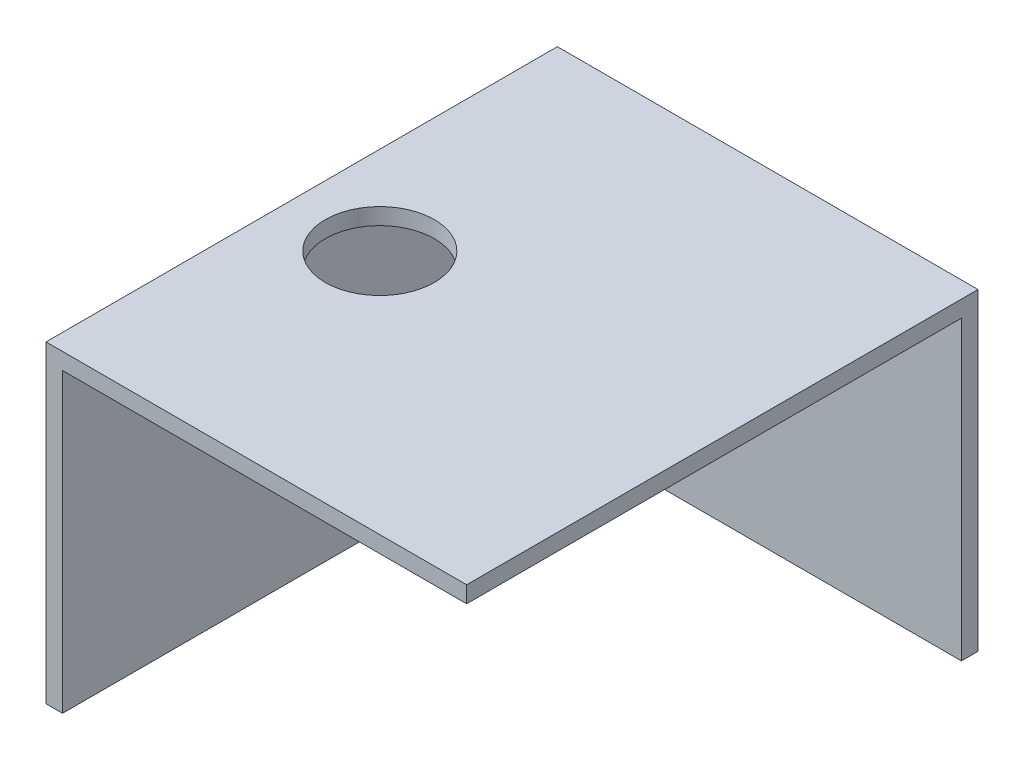
ISO-10303-21;
HEADER;
FILE_DESCRIPTION(('STEP AP214'),'2;1');
FILE_NAME('part.step','',(''),(''),'','','');
FILE_SCHEMA(('AUTOMOTIVE_DESIGN { 1 0 10303 214 1 1 1 1 }'));
ENDSEC;
DATA;
#1=APPLICATION_CONTEXT('core data for automotive mechanical design processes');
#2=APPLICATION_PROTOCOL_DEFINITION('international standard','automotive_design',2000,#1);
#3=PRODUCT_CONTEXT('',#1,'mechanical');
#4=PRODUCT('Part','Part','',(#3));
#5=PRODUCT_RELATED_PRODUCT_CATEGORY('part','',(#4));
#6=PRODUCT_DEFINITION_FORMATION('','',#4);
#7=PRODUCT_DEFINITION_CONTEXT('part definition',#1,'design');
#8=PRODUCT_DEFINITION('design','',#6,#7);
#9=PRODUCT_DEFINITION_SHAPE('','',#8);
#10=(LENGTH_UNIT() NAMED_UNIT(*) SI_UNIT(.MILLI.,.METRE.));
#11=(NAMED_UNIT(*) PLANE_ANGLE_UNIT() SI_UNIT($,.RADIAN.));
#12=(NAMED_UNIT(*) SI_UNIT($,.STERADIAN.) SOLID_ANGLE_UNIT());
#13=UNCERTAINTY_MEASURE_WITH_UNIT(LENGTH_MEASURE(1.E-05),#10,'distance_accuracy_value','');
#14=(GEOMETRIC_REPRESENTATION_CONTEXT(3) GLOBAL_UNCERTAINTY_ASSIGNED_CONTEXT((#13)) GLOBAL_UNIT_ASSIGNED_CONTEXT((#10,
#11,#12)) REPRESENTATION_CONTEXT('',''));
#15=CARTESIAN_POINT('',(0.,0.,0.));
#16=DIRECTION('',(0.,0.,1.));
#17=DIRECTION('',(1.,0.,0.));
#18=AXIS2_PLACEMENT_3D('',#15,#16,#17);
#19=CARTESIAN_POINT('',(-62.1012572167531,72.274050100301,96.8075031768886));
#20=DIRECTION('',(0.,0.,1.));
#21=DIRECTION('',(1.,0.,0.));
#22=AXIS2_PLACEMENT_3D('',#19,#20,#21);
#23=PLANE('',#22);
#24=DIRECTION('',(1.,0.,0.));
#25=VECTOR('',#24,1.);
#26=CARTESIAN_POINT('',(-62.1012572167531,74.274050100301,96.8075031768886));
#27=LINE('',#26,#25);
#28=CARTESIAN_POINT('',(-64.1012572167531,74.274050100301,96.8075031768886));
#29=VERTEX_POINT('',#28);
#30=CARTESIAN_POINT('',(-13.1012572167531,74.274050100301,96.8075031768886));
#31=VERTEX_POINT('',#30);
#32=EDGE_CURVE('E99',#29,#31,#27,.T.);
#33=ORIENTED_EDGE('',*,*,#32,.F.);
#34=DIRECTION('',(0.,-1.,0.));
#35=VECTOR('',#34,1.);
#36=CARTESIAN_POINT('',(-64.1012572167531,74.274050100301,96.8075031768886));
#37=LINE('',#36,#35);
#38=CARTESIAN_POINT('',(-64.1012572167531,36.274050100301,96.8075031768886));
#39=VERTEX_POINT('',#38);
#40=EDGE_CURVE('E102',#29,#39,#37,.T.);
#41=ORIENTED_EDGE('',*,*,#40,.T.);
#42=DIRECTION('',(1.,0.,0.));
#43=VECTOR('',#42,1.);
#44=CARTESIAN_POINT('',(-44.9045137990428,36.274050100301,96.8075031768886));
#45=LINE('',#44,#43);
#46=CARTESIAN_POINT('',(-62.1012572167531,36.274050100301,96.8075031768886));
#47=VERTEX_POINT('',#46);
#48=EDGE_CURVE('E135',#39,#47,#45,.T.);
#49=ORIENTED_EDGE('',*,*,#48,.T.);
#50=DIRECTION('',(0.,-1.,0.));
#51=VECTOR('',#50,1.);
#52=CARTESIAN_POINT('',(-62.1012572167531,74.274050100301,96.8075031768886));
#53=LINE('',#52,#51);
#54=CARTESIAN_POINT('',(-62.1012572167531,72.274050100301,96.8075031768886));
#55=VERTEX_POINT('',#54);
#56=EDGE_CURVE('E120',#55,#47,#53,.T.);
#57=ORIENTED_EDGE('',*,*,#56,.F.);
#58=DIRECTION('',(1.,0.,0.));
#59=VECTOR('',#58,1.);
#60=CARTESIAN_POINT('',(-62.1012572167531,72.274050100301,96.8075031768886));
#61=LINE('',#60,#59);
#62=CARTESIAN_POINT('',(-13.1012572167531,72.274050100301,96.8075031768886));
#63=VERTEX_POINT('',#62);
#64=EDGE_CURVE('E156',#55,#63,#61,.T.);
#65=ORIENTED_EDGE('',*,*,#64,.T.);
#66=DIRECTION('',(0.,1.,0.));
#67=VECTOR('',#66,1.);
#68=CARTESIAN_POINT('',(-13.1012572167531,72.274050100301,96.8075031768886));
#69=LINE('',#68,#67);
#70=EDGE_CURVE('E11',#63,#31,#69,.T.);
#71=ORIENTED_EDGE('',*,*,#70,.T.);
#72=EDGE_LOOP('',(#33,#41,#49,#57,#65,#71));
#73=FACE_BOUND('',#72,.T.);
#74=ADVANCED_FACE('F47',(#73),#23,.T.);
#75=CARTESIAN_POINT('',(-13.1012572167531,72.274050100301,36.8075031768886));
#76=DIRECTION('',(-1.,0.,0.));
#77=DIRECTION('',(0.,0.,1.));
#78=AXIS2_PLACEMENT_3D('',#75,#76,#77);
#79=PLANE('',#78);
#80=DIRECTION('',(0.,0.,1.));
#81=VECTOR('',#80,1.);
#82=CARTESIAN_POINT('',(-13.1012572167531,74.274050100301,36.8075031768886));
#83=LINE('',#82,#81);
#84=CARTESIAN_POINT('',(-13.1012572167533,74.274050100301,34.8075031768886));
#85=VERTEX_POINT('',#84);
#86=EDGE_CURVE('E109',#85,#31,#83,.T.);
#87=ORIENTED_EDGE('',*,*,#86,.T.);
#88=ORIENTED_EDGE('',*,*,#70,.F.);
#89=DIRECTION('',(0.,0.,1.));
#90=VECTOR('',#89,1.);
#91=CARTESIAN_POINT('',(-13.1012572167531,72.274050100301,36.8075031768886));
#92=LINE('',#91,#90);
#93=CARTESIAN_POINT('',(-13.1012572167531,72.274050100301,36.8075031768886));
#94=VERTEX_POINT('',#93);
#95=EDGE_CURVE('E158',#94,#63,#92,.T.);
#96=ORIENTED_EDGE('',*,*,#95,.F.);
#97=DIRECTION('',(0.,-1.,0.));
#98=VECTOR('',#97,1.);
#99=CARTESIAN_POINT('',(-13.1012572167533,74.274050100301,36.8075031768886));
#100=LINE('',#99,#98);
#101=CARTESIAN_POINT('',(-13.1012572167533,36.274050100301,36.8075031768886));
#102=VERTEX_POINT('',#101);
#103=EDGE_CURVE('E62',#94,#102,#100,.T.);
#104=ORIENTED_EDGE('',*,*,#103,.T.);
#105=DIRECTION('',(0.,0.,-1.));
#106=VECTOR('',#105,1.);
#107=CARTESIAN_POINT('',(-13.1012572167533,36.274050100301,76.0313836749102));
#108=LINE('',#107,#106);
#109=CARTESIAN_POINT('',(-13.1012572167533,36.274050100301,34.8075031768886));
#110=VERTEX_POINT('',#109);
#111=EDGE_CURVE('E131',#102,#110,#108,.T.);
#112=ORIENTED_EDGE('',*,*,#111,.T.);
#113=DIRECTION('',(0.,-1.,0.));
#114=VECTOR('',#113,1.);
#115=CARTESIAN_POINT('',(-13.1012572167533,74.274050100301,34.8075031768886));
#116=LINE('',#115,#114);
#117=EDGE_CURVE('E145',#85,#110,#116,.T.);
#118=ORIENTED_EDGE('',*,*,#117,.F.);
#119=EDGE_LOOP('',(#87,#88,#96,#104,#112,#118));
#120=FACE_BOUND('',#119,.T.);
#121=ADVANCED_FACE('F164',(#120),#79,.F.);
#122=CARTESIAN_POINT('',(-44.9045137990428,72.274050100301,76.0313836749102));
#123=DIRECTION('',(0.,-1.,0.));
#124=DIRECTION('',(0.,0.,-1.));
#125=AXIS2_PLACEMENT_3D('',#122,#123,#124);
#126=PLANE('',#125);
#127=CARTESIAN_POINT('',(-53.4045137990428,72.274050100301,67.0313836749103));
#128=DIRECTION('',(0.,1.,0.));
#129=DIRECTION('',(0.,0.,1.));
#130=AXIS2_PLACEMENT_3D('',#127,#128,#129);
#131=CIRCLE('',#130,6.60911000448082);
#132=CARTESIAN_POINT('',(-53.4045137990428,72.274050100301,73.6404936793911));
#133=VERTEX_POINT('',#132);
#134=EDGE_CURVE('E110',#133,#133,#131,.T.);
#135=ORIENTED_EDGE('',*,*,#134,.T.);
#136=EDGE_LOOP('',(#135));
#137=FACE_BOUND('',#136,.T.);
#138=ORIENTED_EDGE('',*,*,#64,.F.);
#139=DIRECTION('',(0.,0.,1.));
#140=VECTOR('',#139,1.);
#141=CARTESIAN_POINT('',(-62.1012572167531,72.274050100301,36.8075031768886));
#142=LINE('',#141,#140);
#143=CARTESIAN_POINT('',(-62.1012572167531,72.274050100301,36.8075031768886));
#144=VERTEX_POINT('',#143);
#145=EDGE_CURVE('E55',#144,#55,#142,.T.);
#146=ORIENTED_EDGE('',*,*,#145,.F.);
#147=DIRECTION('',(1.,0.,0.));
#148=VECTOR('',#147,1.);
#149=CARTESIAN_POINT('',(-62.1012572167531,72.274050100301,36.8075031768886));
#150=LINE('',#149,#148);
#151=EDGE_CURVE('E160',#144,#94,#150,.T.);
#152=ORIENTED_EDGE('',*,*,#151,.T.);
#153=ORIENTED_EDGE('',*,*,#95,.T.);
#154=EDGE_LOOP('',(#138,#146,#152,#153));
#155=FACE_BOUND('',#154,.T.);
#156=ADVANCED_FACE('F178',(#137,#155),#126,.T.);
#157=CARTESIAN_POINT('',(-53.4045137990428,72.274050100301,67.0313836749103));
#158=DIRECTION('',(0.,1.,0.));
#159=DIRECTION('',(0.,0.,1.));
#160=AXIS2_PLACEMENT_3D('',#157,#158,#159);
#161=CYLINDRICAL_SURFACE('',#160,6.60911000448082);
#162=ORIENTED_EDGE('',*,*,#134,.F.);
#163=EDGE_LOOP('',(#162));
#164=FACE_BOUND('',#163,.T.);
#165=CARTESIAN_POINT('',(-53.4045137990428,74.274050100301,67.0313836749103));
#166=DIRECTION('',(0.,1.,0.));
#167=DIRECTION('',(0.,0.,1.));
#168=AXIS2_PLACEMENT_3D('',#165,#166,#167);
#169=CIRCLE('',#168,6.60911000448082);
#170=CARTESIAN_POINT('',(-53.4045137990428,74.274050100301,73.6404936793911));
#171=VERTEX_POINT('',#170);
#172=EDGE_CURVE('E119',#171,#171,#169,.T.);
#173=ORIENTED_EDGE('',*,*,#172,.T.);
#174=EDGE_LOOP('',(#173));
#175=FACE_BOUND('',#174,.T.);
#176=ADVANCED_FACE('F183',(#164,#175),#161,.F.);
#177=CARTESIAN_POINT('',(-62.1012572167531,74.274050100301,76.0313836749102));
#178=DIRECTION('',(-1.,0.,0.));
#179=DIRECTION('',(0.,0.,1.));
#180=AXIS2_PLACEMENT_3D('',#177,#178,#179);
#181=PLANE('',#180);
#182=DIRECTION('',(0.,-1.,0.));
#183=VECTOR('',#182,1.);
#184=CARTESIAN_POINT('',(-62.1012572167531,74.274050100301,36.8075031768886));
#185=LINE('',#184,#183);
#186=CARTESIAN_POINT('',(-62.1012572167531,36.274050100301,36.8075031768886));
#187=VERTEX_POINT('',#186);
#188=EDGE_CURVE('E149',#144,#187,#185,.T.);
#189=ORIENTED_EDGE('',*,*,#188,.F.);
#190=ORIENTED_EDGE('',*,*,#145,.T.);
#191=ORIENTED_EDGE('',*,*,#56,.T.);
#192=DIRECTION('',(0.,0.,-1.));
#193=VECTOR('',#192,1.);
#194=CARTESIAN_POINT('',(-62.1012572167531,36.274050100301,76.0313836749102));
#195=LINE('',#194,#193);
#196=EDGE_CURVE('E137',#47,#187,#195,.T.);
#197=ORIENTED_EDGE('',*,*,#196,.T.);
#198=EDGE_LOOP('',(#189,#190,#191,#197));
#199=FACE_BOUND('',#198,.T.);
#200=ADVANCED_FACE('F181',(#199),#181,.F.);
#201=CARTESIAN_POINT('',(-44.9045137990428,74.274050100301,36.8075031768886));
#202=DIRECTION('',(0.,0.,1.));
#203=DIRECTION('',(1.,0.,0.));
#204=AXIS2_PLACEMENT_3D('',#201,#202,#203);
#205=PLANE('',#204);
#206=ORIENTED_EDGE('',*,*,#151,.F.);
#207=ORIENTED_EDGE('',*,*,#188,.T.);
#208=DIRECTION('',(-1.,0.,0.));
#209=VECTOR('',#208,1.);
#210=CARTESIAN_POINT('',(-44.9045137990428,36.274050100301,36.8075031768886));
#211=LINE('',#210,#209);
#212=EDGE_CURVE('E140',#102,#187,#211,.T.);
#213=ORIENTED_EDGE('',*,*,#212,.F.);
#214=ORIENTED_EDGE('',*,*,#103,.F.);
#215=EDGE_LOOP('',(#206,#207,#213,#214));
#216=FACE_BOUND('',#215,.T.);
#217=ADVANCED_FACE('F179',(#216),#205,.T.);
#218=CARTESIAN_POINT('',(-64.1012572167531,74.274050100301,76.0313836749102));
#219=DIRECTION('',(-1.,0.,0.));
#220=DIRECTION('',(0.,0.,1.));
#221=AXIS2_PLACEMENT_3D('',#218,#219,#220);
#222=PLANE('',#221);
#223=DIRECTION('',(0.,0.,-1.));
#224=VECTOR('',#223,1.);
#225=CARTESIAN_POINT('',(-64.1012572167531,36.274050100301,76.0313836749102));
#226=LINE('',#225,#224);
#227=CARTESIAN_POINT('',(-64.1012572167531,36.274050100301,34.8075031768886));
#228=VERTEX_POINT('',#227);
#229=EDGE_CURVE('E118',#39,#228,#226,.T.);
#230=ORIENTED_EDGE('',*,*,#229,.F.);
#231=ORIENTED_EDGE('',*,*,#40,.F.);
#232=DIRECTION('',(0.,0.,-1.));
#233=VECTOR('',#232,1.);
#234=CARTESIAN_POINT('',(-64.1012572167531,74.274050100301,76.0313836749102));
#235=LINE('',#234,#233);
#236=CARTESIAN_POINT('',(-64.1012572167531,74.274050100301,34.8075031768886));
#237=VERTEX_POINT('',#236);
#238=EDGE_CURVE('E116',#29,#237,#235,.T.);
#239=ORIENTED_EDGE('',*,*,#238,.T.);
#240=DIRECTION('',(0.,-1.,0.));
#241=VECTOR('',#240,1.);
#242=CARTESIAN_POINT('',(-64.1012572167531,74.274050100301,34.8075031768886));
#243=LINE('',#242,#241);
#244=EDGE_CURVE('E128',#237,#228,#243,.T.);
#245=ORIENTED_EDGE('',*,*,#244,.T.);
#246=EDGE_LOOP('',(#230,#231,#239,#245));
#247=FACE_BOUND('',#246,.T.);
#248=ADVANCED_FACE('F115',(#247),#222,.T.);
#249=CARTESIAN_POINT('',(-44.9045137990428,74.274050100301,34.8075031768886));
#250=DIRECTION('',(0.,0.,1.));
#251=DIRECTION('',(1.,0.,0.));
#252=AXIS2_PLACEMENT_3D('',#249,#250,#251);
#253=PLANE('',#252);
#254=DIRECTION('',(-1.,0.,0.));
#255=VECTOR('',#254,1.);
#256=CARTESIAN_POINT('',(-44.9045137990428,36.274050100301,34.8075031768886));
#257=LINE('',#256,#255);
#258=EDGE_CURVE('E126',#110,#228,#257,.T.);
#259=ORIENTED_EDGE('',*,*,#258,.T.);
#260=ORIENTED_EDGE('',*,*,#244,.F.);
#261=DIRECTION('',(-1.,0.,0.));
#262=VECTOR('',#261,1.);
#263=CARTESIAN_POINT('',(-44.9045137990428,74.274050100301,34.8075031768886));
#264=LINE('',#263,#262);
#265=EDGE_CURVE('E124',#85,#237,#264,.T.);
#266=ORIENTED_EDGE('',*,*,#265,.F.);
#267=ORIENTED_EDGE('',*,*,#117,.T.);
#268=EDGE_LOOP('',(#259,#260,#266,#267));
#269=FACE_BOUND('',#268,.T.);
#270=ADVANCED_FACE('F169',(#269),#253,.F.);
#271=CARTESIAN_POINT('',(-44.9045137990428,36.274050100301,76.0313836749102));
#272=DIRECTION('',(0.,1.,0.));
#273=DIRECTION('',(0.,0.,1.));
#274=AXIS2_PLACEMENT_3D('',#271,#272,#273);
#275=PLANE('',#274);
#276=ORIENTED_EDGE('',*,*,#229,.T.);
#277=ORIENTED_EDGE('',*,*,#258,.F.);
#278=ORIENTED_EDGE('',*,*,#111,.F.);
#279=ORIENTED_EDGE('',*,*,#212,.T.);
#280=ORIENTED_EDGE('',*,*,#196,.F.);
#281=ORIENTED_EDGE('',*,*,#48,.F.);
#282=EDGE_LOOP('',(#276,#277,#278,#279,#280,#281));
#283=FACE_BOUND('',#282,.T.);
#284=ADVANCED_FACE('F171',(#283),#275,.F.);
#285=CARTESIAN_POINT('',(-44.9045137990428,74.274050100301,76.0313836749102));
#286=DIRECTION('',(0.,-1.,0.));
#287=DIRECTION('',(0.,0.,-1.));
#288=AXIS2_PLACEMENT_3D('',#285,#286,#287);
#289=PLANE('',#288);
#290=ORIENTED_EDGE('',*,*,#172,.F.);
#291=EDGE_LOOP('',(#290));
#292=FACE_BOUND('',#291,.T.);
#293=ORIENTED_EDGE('',*,*,#32,.T.);
#294=ORIENTED_EDGE('',*,*,#86,.F.);
#295=ORIENTED_EDGE('',*,*,#265,.T.);
#296=ORIENTED_EDGE('',*,*,#238,.F.);
#297=EDGE_LOOP('',(#293,#294,#295,#296));
#298=FACE_BOUND('',#297,.T.);
#299=ADVANCED_FACE('F122',(#292,#298),#289,.F.);
#300=CLOSED_SHELL('',(#74,#121,#156,#176,#200,#217,#248,#270,#284,#299));
#301=MANIFOLD_SOLID_BREP('B2',#300);
#302=ADVANCED_BREP_SHAPE_REPRESENTATION('',(#18,#301),#14);
#303=SHAPE_DEFINITION_REPRESENTATION(#9,#302);
ENDSEC;
END-ISO-10303-21;
